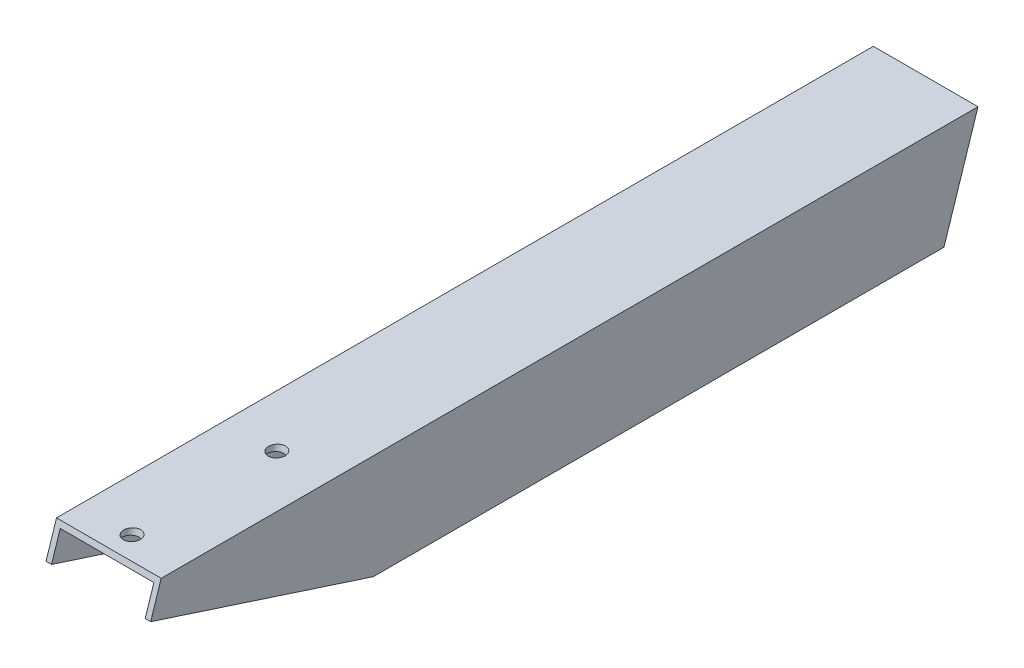
ISO-10303-21;
HEADER;
FILE_DESCRIPTION(('STEP AP214'),'2;1');
FILE_NAME('part.step','',(''),(''),'','','');
FILE_SCHEMA(('AUTOMOTIVE_DESIGN { 1 0 10303 214 1 1 1 1 }'));
ENDSEC;
DATA;
#1=APPLICATION_CONTEXT('core data for automotive mechanical design processes');
#2=APPLICATION_PROTOCOL_DEFINITION('international standard','automotive_design',2000,#1);
#3=PRODUCT_CONTEXT('',#1,'mechanical');
#4=PRODUCT('Part','Part','',(#3));
#5=PRODUCT_RELATED_PRODUCT_CATEGORY('part','',(#4));
#6=PRODUCT_DEFINITION_FORMATION('','',#4);
#7=PRODUCT_DEFINITION_CONTEXT('part definition',#1,'design');
#8=PRODUCT_DEFINITION('design','',#6,#7);
#9=PRODUCT_DEFINITION_SHAPE('','',#8);
#10=(LENGTH_UNIT() NAMED_UNIT(*) SI_UNIT(.MILLI.,.METRE.));
#11=(NAMED_UNIT(*) PLANE_ANGLE_UNIT() SI_UNIT($,.RADIAN.));
#12=(NAMED_UNIT(*) SI_UNIT($,.STERADIAN.) SOLID_ANGLE_UNIT());
#13=UNCERTAINTY_MEASURE_WITH_UNIT(LENGTH_MEASURE(1.E-05),#10,'distance_accuracy_value','');
#14=(GEOMETRIC_REPRESENTATION_CONTEXT(3) GLOBAL_UNCERTAINTY_ASSIGNED_CONTEXT((#13)) GLOBAL_UNIT_ASSIGNED_CONTEXT((#10,
#11,#12)) REPRESENTATION_CONTEXT('',''));
#15=CARTESIAN_POINT('',(0.,0.,0.));
#16=DIRECTION('',(0.,0.,1.));
#17=DIRECTION('',(1.,0.,0.));
#18=AXIS2_PLACEMENT_3D('',#15,#16,#17);
#19=CARTESIAN_POINT('',(9.5,9.5,-260.));
#20=DIRECTION('',(-1.,0.,0.));
#21=DIRECTION('',(0.,0.,-1.));
#22=AXIS2_PLACEMENT_3D('',#19,#20,#21);
#23=PLANE('',#22);
#24=DIRECTION('',(0.,-0.309016994374942,-0.951056516295155));
#25=VECTOR('',#24,1.);
#26=CARTESIAN_POINT('',(9.5,9.5,0.));
#27=LINE('',#26,#25);
#28=CARTESIAN_POINT('',(9.5,3.62867710687612,-18.0700738096079));
#29=VERTEX_POINT('',#28);
#30=CARTESIAN_POINT('',(9.5,-9.5,-58.475987206331));
#31=VERTEX_POINT('',#30);
#32=EDGE_CURVE('E133',#29,#31,#27,.T.);
#33=ORIENTED_EDGE('',*,*,#32,.T.);
#34=DIRECTION('',(0.,0.,1.));
#35=VECTOR('',#34,1.);
#36=CARTESIAN_POINT('',(9.5,-9.5,-260.));
#37=LINE('',#36,#35);
#38=CARTESIAN_POINT('',(9.5,-9.5,-162.060481649697));
#39=VERTEX_POINT('',#38);
#40=EDGE_CURVE('E150',#39,#31,#37,.T.);
#41=ORIENTED_EDGE('',*,*,#40,.F.);
#42=DIRECTION('',(0.,0.951056516295156,-0.309016994374941));
#43=VECTOR('',#42,1.);
#44=CARTESIAN_POINT('',(9.5,10.4737170732223,-168.550335733771));
#45=LINE('',#44,#43);
#46=CARTESIAN_POINT('',(9.5,9.5,-168.233955878122));
#47=VERTEX_POINT('',#46);
#48=EDGE_CURVE('E179',#39,#47,#45,.T.);
#49=ORIENTED_EDGE('',*,*,#48,.T.);
#50=DIRECTION('',(0.,0.,1.));
#51=VECTOR('',#50,1.);
#52=CARTESIAN_POINT('',(9.5,9.5,-260.));
#53=LINE('',#52,#51);
#54=CARTESIAN_POINT('',(9.5,9.50000000000002,-19.977782260527));
#55=VERTEX_POINT('',#54);
#56=EDGE_CURVE('E164',#47,#55,#53,.T.);
#57=ORIENTED_EDGE('',*,*,#56,.T.);
#58=DIRECTION('',(0.,-0.951056516295155,0.309016994374942));
#59=VECTOR('',#58,1.);
#60=CARTESIAN_POINT('',(9.5,53.0713962068668,-34.1349870805055));
#61=LINE('',#60,#59);
#62=EDGE_CURVE('E127',#55,#29,#61,.T.);
#63=ORIENTED_EDGE('',*,*,#62,.T.);
#64=EDGE_LOOP('',(#33,#41,#49,#57,#63));
#65=FACE_BOUND('',#64,.T.);
#66=ADVANCED_FACE('F35',(#65),#23,.F.);
#67=CARTESIAN_POINT('',(-9.5,9.5,-260.));
#68=DIRECTION('',(0.,-1.,0.));
#69=DIRECTION('',(0.,0.,1.));
#70=AXIS2_PLACEMENT_3D('',#67,#68,#69);
#71=PLANE('',#70);
#72=CARTESIAN_POINT('',(0.,9.5,-24.1836311574801));
#73=DIRECTION('',(0.,1.,0.));
#74=DIRECTION('',(0.,0.,1.));
#75=AXIS2_PLACEMENT_3D('',#72,#73,#74);
#76=ELLIPSE('',#75,1.5771933363574,1.5);
#77=CARTESIAN_POINT('',(0.,9.5,-22.6064378211227));
#78=VERTEX_POINT('',#77);
#79=EDGE_CURVE('E175',#78,#78,#76,.F.);
#80=ORIENTED_EDGE('',*,*,#79,.T.);
#81=EDGE_LOOP('',(#80));
#82=FACE_BOUND('',#81,.T.);
#83=CARTESIAN_POINT('',(0.,9.5,-50.4701867634367));
#84=DIRECTION('',(0.,1.,0.));
#85=DIRECTION('',(0.,0.,1.));
#86=AXIS2_PLACEMENT_3D('',#83,#84,#85);
#87=ELLIPSE('',#86,1.5771933363574,1.5);
#88=CARTESIAN_POINT('',(0.,9.5,-48.8929934270793));
#89=VERTEX_POINT('',#88);
#90=EDGE_CURVE('E172',#89,#89,#87,.F.);
#91=ORIENTED_EDGE('',*,*,#90,.T.);
#92=EDGE_LOOP('',(#91));
#93=FACE_BOUND('',#92,.T.);
#94=ORIENTED_EDGE('',*,*,#56,.F.);
#95=DIRECTION('',(1.,0.,0.));
#96=VECTOR('',#95,1.);
#97=CARTESIAN_POINT('',(-9.5,9.5,-168.233955878122));
#98=LINE('',#97,#96);
#99=CARTESIAN_POINT('',(-9.5,9.5,-168.233955878122));
#100=VERTEX_POINT('',#99);
#101=EDGE_CURVE('E137',#100,#47,#98,.T.);
#102=ORIENTED_EDGE('',*,*,#101,.F.);
#103=DIRECTION('',(0.,0.,1.));
#104=VECTOR('',#103,1.);
#105=CARTESIAN_POINT('',(-9.5,9.5,-260.));
#106=LINE('',#105,#104);
#107=CARTESIAN_POINT('',(-9.5,9.50000000000003,-19.977782260527));
#108=VERTEX_POINT('',#107);
#109=EDGE_CURVE('E162',#100,#108,#106,.T.);
#110=ORIENTED_EDGE('',*,*,#109,.T.);
#111=DIRECTION('',(-1.,0.,0.));
#112=VECTOR('',#111,1.);
#113=CARTESIAN_POINT('',(-9.49999999999995,9.5,-19.977782260527));
#114=LINE('',#113,#112);
#115=EDGE_CURVE('E122',#55,#108,#114,.T.);
#116=ORIENTED_EDGE('',*,*,#115,.F.);
#117=EDGE_LOOP('',(#94,#102,#110,#116));
#118=FACE_BOUND('',#117,.T.);
#119=ADVANCED_FACE('F203',(#82,#93,#118),#71,.F.);
#120=CARTESIAN_POINT('',(-9.5,9.5,-260.));
#121=DIRECTION('',(1.,0.,0.));
#122=DIRECTION('',(0.,1.,0.));
#123=AXIS2_PLACEMENT_3D('',#120,#121,#122);
#124=PLANE('',#123);
#125=ORIENTED_EDGE('',*,*,#109,.F.);
#126=DIRECTION('',(0.,0.951056516295156,-0.309016994374941));
#127=VECTOR('',#126,1.);
#128=CARTESIAN_POINT('',(-9.5,59.6111960038957,-184.516070461575));
#129=LINE('',#128,#127);
#130=CARTESIAN_POINT('',(-9.5,-9.5,-162.060481649697));
#131=VERTEX_POINT('',#130);
#132=EDGE_CURVE('E188',#131,#100,#129,.T.);
#133=ORIENTED_EDGE('',*,*,#132,.F.);
#134=DIRECTION('',(0.,0.,1.));
#135=VECTOR('',#134,1.);
#136=CARTESIAN_POINT('',(-9.5,-9.5,-260.));
#137=LINE('',#136,#135);
#138=CARTESIAN_POINT('',(-9.5,-9.5,-58.475987206331));
#139=VERTEX_POINT('',#138);
#140=EDGE_CURVE('E131',#131,#139,#137,.T.);
#141=ORIENTED_EDGE('',*,*,#140,.T.);
#142=DIRECTION('',(0.,-0.309016994374942,-0.951056516295155));
#143=VECTOR('',#142,1.);
#144=CARTESIAN_POINT('',(-9.5,9.5,0.));
#145=LINE('',#144,#143);
#146=CARTESIAN_POINT('',(-9.5,3.62867710687612,-18.0700738096079));
#147=VERTEX_POINT('',#146);
#148=EDGE_CURVE('E114',#147,#139,#145,.T.);
#149=ORIENTED_EDGE('',*,*,#148,.F.);
#150=DIRECTION('',(0.,-0.951056516295155,0.309016994374942));
#151=VECTOR('',#150,1.);
#152=CARTESIAN_POINT('',(-9.5,53.0713962068668,-34.1349870805055));
#153=LINE('',#152,#151);
#154=EDGE_CURVE('E120',#108,#147,#153,.T.);
#155=ORIENTED_EDGE('',*,*,#154,.F.);
#156=EDGE_LOOP('',(#125,#133,#141,#149,#155));
#157=FACE_BOUND('',#156,.T.);
#158=ADVANCED_FACE('F129',(#157),#124,.F.);
#159=CARTESIAN_POINT('',(-9.5,-9.5,-260.));
#160=DIRECTION('',(0.,1.,0.));
#161=DIRECTION('',(-1.,0.,0.));
#162=AXIS2_PLACEMENT_3D('',#159,#160,#161);
#163=PLANE('',#162);
#164=ORIENTED_EDGE('',*,*,#40,.T.);
#165=DIRECTION('',(1.,0.,0.));
#166=VECTOR('',#165,1.);
#167=CARTESIAN_POINT('',(-9.5,-9.5,-58.475987206331));
#168=LINE('',#167,#166);
#169=EDGE_CURVE('E132',#139,#31,#168,.T.);
#170=ORIENTED_EDGE('',*,*,#169,.F.);
#171=ORIENTED_EDGE('',*,*,#140,.F.);
#172=DIRECTION('',(-1.,0.,0.));
#173=VECTOR('',#172,1.);
#174=CARTESIAN_POINT('',(-9.5,-9.5,-162.060481649697));
#175=LINE('',#174,#173);
#176=EDGE_CURVE('E57',#39,#131,#175,.T.);
#177=ORIENTED_EDGE('',*,*,#176,.F.);
#178=EDGE_LOOP('',(#164,#170,#171,#177));
#179=FACE_BOUND('',#178,.T.);
#180=ADVANCED_FACE('F207',(#179),#163,.F.);
#181=CARTESIAN_POINT('',(8.5,9.5,-260.));
#182=DIRECTION('',(-1.,0.,0.));
#183=DIRECTION('',(0.,0.,-1.));
#184=AXIS2_PLACEMENT_3D('',#181,#182,#183);
#185=PLANE('',#184);
#186=DIRECTION('',(0.,0.951056516295155,-0.309016994374942));
#187=VECTOR('',#186,1.);
#188=CARTESIAN_POINT('',(8.5,80.0407599048963,-42.8978645408639));
#189=LINE('',#188,#187);
#190=CARTESIAN_POINT('',(8.49999999999999,3.62867710687612,-18.0700738096079));
#191=VERTEX_POINT('',#190);
#192=CARTESIAN_POINT('',(8.49999999999999,8.5,-19.6528625642941));
#193=VERTEX_POINT('',#192);
#194=EDGE_CURVE('E214',#191,#193,#189,.T.);
#195=ORIENTED_EDGE('',*,*,#194,.T.);
#196=DIRECTION('',(0.,0.,1.));
#197=VECTOR('',#196,1.);
#198=CARTESIAN_POINT('',(8.5,8.5,-260.));
#199=LINE('',#198,#197);
#200=CARTESIAN_POINT('',(8.49999999999999,8.5,-167.90903618189));
#201=VERTEX_POINT('',#200);
#202=EDGE_CURVE('E147',#201,#193,#199,.T.);
#203=ORIENTED_EDGE('',*,*,#202,.F.);
#204=DIRECTION('',(0.,-0.951056516295156,0.309016994374941));
#205=VECTOR('',#204,1.);
#206=CARTESIAN_POINT('',(8.5,36.4693636980295,-176.996833338481));
#207=LINE('',#206,#205);
#208=CARTESIAN_POINT('',(8.5,-8.49999999999999,-162.38540134593));
#209=VERTEX_POINT('',#208);
#210=EDGE_CURVE('E196',#201,#209,#207,.T.);
#211=ORIENTED_EDGE('',*,*,#210,.T.);
#212=DIRECTION('',(0.,0.,1.));
#213=VECTOR('',#212,1.);
#214=CARTESIAN_POINT('',(8.5,-8.49999999999999,-260.));
#215=LINE('',#214,#213);
#216=CARTESIAN_POINT('',(8.49999999999999,-8.5,-55.3983036691557));
#217=VERTEX_POINT('',#216);
#218=EDGE_CURVE('E146',#209,#217,#215,.T.);
#219=ORIENTED_EDGE('',*,*,#218,.T.);
#220=DIRECTION('',(0.,0.309016994374942,0.951056516295156));
#221=VECTOR('',#220,1.);
#222=CARTESIAN_POINT('',(8.5,-66.9120827980202,-235.172209268744));
#223=LINE('',#222,#221);
#224=EDGE_CURVE('E143',#217,#191,#223,.T.);
#225=ORIENTED_EDGE('',*,*,#224,.T.);
#226=EDGE_LOOP('',(#195,#203,#211,#219,#225));
#227=FACE_BOUND('',#226,.T.);
#228=ADVANCED_FACE('F212',(#227),#185,.T.);
#229=CARTESIAN_POINT('',(-9.5,8.5,-260.));
#230=DIRECTION('',(0.,-1.,0.));
#231=DIRECTION('',(0.,0.,1.));
#232=AXIS2_PLACEMENT_3D('',#229,#230,#231);
#233=PLANE('',#232);
#234=DIRECTION('',(-1.,0.,0.));
#235=VECTOR('',#234,1.);
#236=CARTESIAN_POINT('',(-9.49999999999995,8.5,-19.6528625642941));
#237=LINE('',#236,#235);
#238=CARTESIAN_POINT('',(-8.5,8.50000000000001,-19.6528625642942));
#239=VERTEX_POINT('',#238);
#240=EDGE_CURVE('E217',#193,#239,#237,.T.);
#241=ORIENTED_EDGE('',*,*,#240,.T.);
#242=DIRECTION('',(0.,0.,1.));
#243=VECTOR('',#242,1.);
#244=CARTESIAN_POINT('',(-8.5,8.5,-260.));
#245=LINE('',#244,#243);
#246=CARTESIAN_POINT('',(-8.5,8.5,-167.90903618189));
#247=VERTEX_POINT('',#246);
#248=EDGE_CURVE('E151',#247,#239,#245,.T.);
#249=ORIENTED_EDGE('',*,*,#248,.F.);
#250=DIRECTION('',(1.,0.,0.));
#251=VECTOR('',#250,1.);
#252=CARTESIAN_POINT('',(-9.5,8.5,-167.90903618189));
#253=LINE('',#252,#251);
#254=EDGE_CURVE('E194',#247,#201,#253,.T.);
#255=ORIENTED_EDGE('',*,*,#254,.T.);
#256=ORIENTED_EDGE('',*,*,#202,.T.);
#257=EDGE_LOOP('',(#241,#249,#255,#256));
#258=FACE_BOUND('',#257,.T.);
#259=CARTESIAN_POINT('',(0.,8.5,-23.8587114612472));
#260=DIRECTION('',(0.,1.,0.));
#261=DIRECTION('',(0.,0.,1.));
#262=AXIS2_PLACEMENT_3D('',#259,#260,#261);
#263=ELLIPSE('',#262,1.5771933363574,1.5);
#264=CARTESIAN_POINT('',(0.,8.5,-22.2815181248898));
#265=VERTEX_POINT('',#264);
#266=EDGE_CURVE('E173',#265,#265,#263,.F.);
#267=ORIENTED_EDGE('',*,*,#266,.F.);
#268=EDGE_LOOP('',(#267));
#269=FACE_BOUND('',#268,.T.);
#270=CARTESIAN_POINT('',(0.,8.5,-50.1452670672038));
#271=DIRECTION('',(0.,1.,0.));
#272=DIRECTION('',(0.,0.,1.));
#273=AXIS2_PLACEMENT_3D('',#270,#271,#272);
#274=ELLIPSE('',#273,1.5771933363574,1.5);
#275=CARTESIAN_POINT('',(0.,8.5,-48.5680737308464));
#276=VERTEX_POINT('',#275);
#277=EDGE_CURVE('E170',#276,#276,#274,.F.);
#278=ORIENTED_EDGE('',*,*,#277,.F.);
#279=EDGE_LOOP('',(#278));
#280=FACE_BOUND('',#279,.T.);
#281=ADVANCED_FACE('F228',(#258,#269,#280),#233,.T.);
#282=CARTESIAN_POINT('',(-8.5,9.5,-260.));
#283=DIRECTION('',(1.,0.,0.));
#284=DIRECTION('',(0.,1.,0.));
#285=AXIS2_PLACEMENT_3D('',#282,#283,#284);
#286=PLANE('',#285);
#287=DIRECTION('',(0.,-0.951056516295155,0.309016994374942));
#288=VECTOR('',#287,1.);
#289=CARTESIAN_POINT('',(-8.50000000000001,80.0407599048963,-42.8978645408639));
#290=LINE('',#289,#288);
#291=CARTESIAN_POINT('',(-8.5,3.62867710687612,-18.0700738096079));
#292=VERTEX_POINT('',#291);
#293=EDGE_CURVE('E126',#239,#292,#290,.T.);
#294=ORIENTED_EDGE('',*,*,#293,.T.);
#295=DIRECTION('',(0.,-0.309016994374942,-0.951056516295156));
#296=VECTOR('',#295,1.);
#297=CARTESIAN_POINT('',(-8.49999999999999,-66.9120827980202,-235.172209268744));
#298=LINE('',#297,#296);
#299=CARTESIAN_POINT('',(-8.5,-8.5,-55.3983036691557));
#300=VERTEX_POINT('',#299);
#301=EDGE_CURVE('E117',#292,#300,#298,.T.);
#302=ORIENTED_EDGE('',*,*,#301,.T.);
#303=DIRECTION('',(0.,0.,1.));
#304=VECTOR('',#303,1.);
#305=CARTESIAN_POINT('',(-8.5,-8.5,-260.));
#306=LINE('',#305,#304);
#307=CARTESIAN_POINT('',(-8.5,-8.5,-162.38540134593));
#308=VERTEX_POINT('',#307);
#309=EDGE_CURVE('E154',#308,#300,#306,.T.);
#310=ORIENTED_EDGE('',*,*,#309,.F.);
#311=DIRECTION('',(0.,0.951056516295156,-0.309016994374941));
#312=VECTOR('',#311,1.);
#313=CARTESIAN_POINT('',(-8.50000000000001,36.4693636980295,-176.996833338481));
#314=LINE('',#313,#312);
#315=EDGE_CURVE('E190',#308,#247,#314,.T.);
#316=ORIENTED_EDGE('',*,*,#315,.T.);
#317=ORIENTED_EDGE('',*,*,#248,.T.);
#318=EDGE_LOOP('',(#294,#302,#310,#316,#317));
#319=FACE_BOUND('',#318,.T.);
#320=ADVANCED_FACE('F222',(#319),#286,.T.);
#321=CARTESIAN_POINT('',(-9.5,-8.5,-260.));
#322=DIRECTION('',(0.,1.,0.));
#323=DIRECTION('',(-1.,0.,0.));
#324=AXIS2_PLACEMENT_3D('',#321,#322,#323);
#325=PLANE('',#324);
#326=DIRECTION('',(-1.,0.,0.));
#327=VECTOR('',#326,1.);
#328=CARTESIAN_POINT('',(-9.5,-8.5,-162.38540134593));
#329=LINE('',#328,#327);
#330=EDGE_CURVE('E42',#209,#308,#329,.T.);
#331=ORIENTED_EDGE('',*,*,#330,.T.);
#332=ORIENTED_EDGE('',*,*,#309,.T.);
#333=DIRECTION('',(1.,0.,0.));
#334=VECTOR('',#333,1.);
#335=CARTESIAN_POINT('',(-9.49999999999994,-8.5,-55.3983036691557));
#336=LINE('',#335,#334);
#337=EDGE_CURVE('E167',#300,#217,#336,.T.);
#338=ORIENTED_EDGE('',*,*,#337,.T.);
#339=ORIENTED_EDGE('',*,*,#218,.F.);
#340=EDGE_LOOP('',(#331,#332,#338,#339));
#341=FACE_BOUND('',#340,.T.);
#342=ADVANCED_FACE('F233',(#341),#325,.T.);
#343=CARTESIAN_POINT('',(-9.5,9.5,0.));
#344=DIRECTION('',(0.,0.951056516295155,-0.309016994374942));
#345=DIRECTION('',(0.,-0.309016994374942,-0.951056516295156));
#346=AXIS2_PLACEMENT_3D('',#343,#344,#345);
#347=PLANE('',#346);
#348=ORIENTED_EDGE('',*,*,#148,.T.);
#349=ORIENTED_EDGE('',*,*,#169,.T.);
#350=ORIENTED_EDGE('',*,*,#32,.F.);
#351=DIRECTION('',(-1.,0.,0.));
#352=VECTOR('',#351,1.);
#353=CARTESIAN_POINT('',(9.5,3.62867710687612,-18.0700738096079));
#354=LINE('',#353,#352);
#355=EDGE_CURVE('E49',#29,#191,#354,.T.);
#356=ORIENTED_EDGE('',*,*,#355,.T.);
#357=ORIENTED_EDGE('',*,*,#224,.F.);
#358=ORIENTED_EDGE('',*,*,#337,.F.);
#359=ORIENTED_EDGE('',*,*,#301,.F.);
#360=DIRECTION('',(1.,0.,0.));
#361=VECTOR('',#360,1.);
#362=CARTESIAN_POINT('',(-9.50000000000001,3.62867710687612,-18.0700738096079));
#363=LINE('',#362,#361);
#364=EDGE_CURVE('E11',#147,#292,#363,.T.);
#365=ORIENTED_EDGE('',*,*,#364,.F.);
#366=EDGE_LOOP('',(#348,#349,#350,#356,#357,#358,#359,#365));
#367=FACE_BOUND('',#366,.T.);
#368=ADVANCED_FACE('F112',(#367),#347,.F.);
#369=CARTESIAN_POINT('',(-9.5,10.4737170732223,-168.550335733771));
#370=DIRECTION('',(0.,0.309016994374941,0.951056516295156));
#371=DIRECTION('',(0.,0.951056516295156,-0.309016994374941));
#372=AXIS2_PLACEMENT_3D('',#369,#370,#371);
#373=PLANE('',#372);
#374=ORIENTED_EDGE('',*,*,#210,.F.);
#375=ORIENTED_EDGE('',*,*,#254,.F.);
#376=ORIENTED_EDGE('',*,*,#315,.F.);
#377=ORIENTED_EDGE('',*,*,#330,.F.);
#378=EDGE_LOOP('',(#374,#375,#376,#377));
#379=FACE_BOUND('',#378,.T.);
#380=ORIENTED_EDGE('',*,*,#132,.T.);
#381=ORIENTED_EDGE('',*,*,#101,.T.);
#382=ORIENTED_EDGE('',*,*,#48,.F.);
#383=ORIENTED_EDGE('',*,*,#176,.T.);
#384=EDGE_LOOP('',(#380,#381,#382,#383));
#385=FACE_BOUND('',#384,.T.);
#386=ADVANCED_FACE('F200',(#379,#385),#373,.F.);
#387=CARTESIAN_POINT('',(0.,44.1099033699935,-61.715626053065));
#388=DIRECTION('',(0.,-0.951056516295155,0.309016994374942));
#389=DIRECTION('',(0.,0.309016994374942,0.951056516295156));
#390=AXIS2_PLACEMENT_3D('',#387,#388,#389);
#391=CYLINDRICAL_SURFACE('',#390,1.5);
#392=ORIENTED_EDGE('',*,*,#277,.T.);
#393=EDGE_LOOP('',(#392));
#394=FACE_BOUND('',#393,.T.);
#395=ORIENTED_EDGE('',*,*,#90,.F.);
#396=EDGE_LOOP('',(#395));
#397=FACE_BOUND('',#396,.T.);
#398=ADVANCED_FACE('F264',(#394,#397),#391,.F.);
#399=CARTESIAN_POINT('',(0.,51.835328229367,-37.9392131456861));
#400=DIRECTION('',(0.,-0.951056516295155,0.309016994374942));
#401=DIRECTION('',(0.,0.309016994374942,0.951056516295156));
#402=AXIS2_PLACEMENT_3D('',#399,#400,#401);
#403=CYLINDRICAL_SURFACE('',#402,1.5);
#404=ORIENTED_EDGE('',*,*,#266,.T.);
#405=EDGE_LOOP('',(#404));
#406=FACE_BOUND('',#405,.T.);
#407=ORIENTED_EDGE('',*,*,#79,.F.);
#408=EDGE_LOOP('',(#407));
#409=FACE_BOUND('',#408,.T.);
#410=ADVANCED_FACE('F267',(#406,#409),#403,.F.);
#411=CARTESIAN_POINT('',(9.5,53.0713962068668,-34.1349870805055));
#412=DIRECTION('',(0.,-0.309016994374942,-0.951056516295155));
#413=DIRECTION('',(0.,-0.951056516295155,0.309016994374942));
#414=AXIS2_PLACEMENT_3D('',#411,#412,#413);
#415=PLANE('',#414);
#416=ORIENTED_EDGE('',*,*,#62,.F.);
#417=ORIENTED_EDGE('',*,*,#115,.T.);
#418=ORIENTED_EDGE('',*,*,#154,.T.);
#419=ORIENTED_EDGE('',*,*,#364,.T.);
#420=ORIENTED_EDGE('',*,*,#293,.F.);
#421=ORIENTED_EDGE('',*,*,#240,.F.);
#422=ORIENTED_EDGE('',*,*,#194,.F.);
#423=ORIENTED_EDGE('',*,*,#355,.F.);
#424=EDGE_LOOP('',(#416,#417,#418,#419,#420,#421,#422,#423));
#425=FACE_BOUND('',#424,.T.);
#426=ADVANCED_FACE('F121',(#425),#415,.F.);
#427=CLOSED_SHELL('',(#66,#119,#158,#180,#228,#281,#320,#342,#368,#386,#398,#410,#426));
#428=MANIFOLD_SOLID_BREP('B2',#427);
#429=ADVANCED_BREP_SHAPE_REPRESENTATION('',(#18,#428),#14);
#430=SHAPE_DEFINITION_REPRESENTATION(#9,#429);
ENDSEC;
END-ISO-10303-21;
